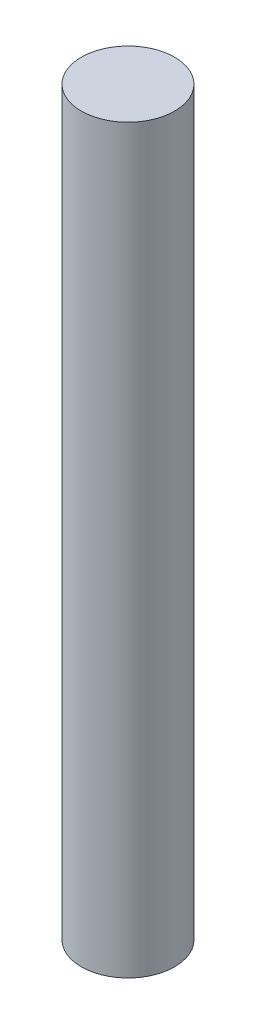
ISO-10303-21;
HEADER;
FILE_DESCRIPTION(('STEP AP214'),'2;1');
FILE_NAME('part.step','',(''),(''),'','','');
FILE_SCHEMA(('AUTOMOTIVE_DESIGN { 1 0 10303 214 1 1 1 1 }'));
ENDSEC;
DATA;
#1=APPLICATION_CONTEXT('core data for automotive mechanical design processes');
#2=APPLICATION_PROTOCOL_DEFINITION('international standard','automotive_design',2000,#1);
#3=PRODUCT_CONTEXT('',#1,'mechanical');
#4=PRODUCT('Part','Part','',(#3));
#5=PRODUCT_RELATED_PRODUCT_CATEGORY('part','',(#4));
#6=PRODUCT_DEFINITION_FORMATION('','',#4);
#7=PRODUCT_DEFINITION_CONTEXT('part definition',#1,'design');
#8=PRODUCT_DEFINITION('design','',#6,#7);
#9=PRODUCT_DEFINITION_SHAPE('','',#8);
#10=(LENGTH_UNIT() NAMED_UNIT(*) SI_UNIT(.MILLI.,.METRE.));
#11=(NAMED_UNIT(*) PLANE_ANGLE_UNIT() SI_UNIT($,.RADIAN.));
#12=(NAMED_UNIT(*) SI_UNIT($,.STERADIAN.) SOLID_ANGLE_UNIT());
#13=UNCERTAINTY_MEASURE_WITH_UNIT(LENGTH_MEASURE(1.E-05),#10,'distance_accuracy_value','');
#14=(GEOMETRIC_REPRESENTATION_CONTEXT(3) GLOBAL_UNCERTAINTY_ASSIGNED_CONTEXT((#13)) GLOBAL_UNIT_ASSIGNED_CONTEXT((#10,
#11,#12)) REPRESENTATION_CONTEXT('',''));
#15=CARTESIAN_POINT('',(0.,0.,0.));
#16=DIRECTION('',(0.,0.,1.));
#17=DIRECTION('',(1.,0.,0.));
#18=AXIS2_PLACEMENT_3D('',#15,#16,#17);
#19=CARTESIAN_POINT('',(0.,100.,0.));
#20=DIRECTION('',(0.,-1.,0.));
#21=DIRECTION('',(0.,0.,-1.));
#22=AXIS2_PLACEMENT_3D('',#19,#20,#21);
#23=CYLINDRICAL_SURFACE('',#22,6.3);
#24=CARTESIAN_POINT('',(0.,100.,0.));
#25=DIRECTION('',(0.,1.,0.));
#26=DIRECTION('',(0.,0.,1.));
#27=AXIS2_PLACEMENT_3D('',#24,#25,#26);
#28=CIRCLE('',#27,6.3);
#29=CARTESIAN_POINT('',(0.,100.,6.3));
#30=VERTEX_POINT('',#29);
#31=EDGE_CURVE('E10',#30,#30,#28,.T.);
#32=ORIENTED_EDGE('',*,*,#31,.F.);
#33=EDGE_LOOP('',(#32));
#34=FACE_BOUND('',#33,.T.);
#35=CARTESIAN_POINT('',(0.,0.,0.));
#36=DIRECTION('',(0.,1.,0.));
#37=DIRECTION('',(0.,0.,1.));
#38=AXIS2_PLACEMENT_3D('',#35,#36,#37);
#39=CIRCLE('',#38,6.3);
#40=CARTESIAN_POINT('',(0.,0.,6.3));
#41=VERTEX_POINT('',#40);
#42=EDGE_CURVE('E34',#41,#41,#39,.T.);
#43=ORIENTED_EDGE('',*,*,#42,.T.);
#44=EDGE_LOOP('',(#43));
#45=FACE_BOUND('',#44,.T.);
#46=ADVANCED_FACE('F31',(#34,#45),#23,.T.);
#47=CARTESIAN_POINT('',(0.,100.,0.));
#48=DIRECTION('',(0.,1.,0.));
#49=DIRECTION('',(0.,0.,1.));
#50=AXIS2_PLACEMENT_3D('',#47,#48,#49);
#51=PLANE('',#50);
#52=ORIENTED_EDGE('',*,*,#31,.T.);
#53=EDGE_LOOP('',(#52));
#54=FACE_BOUND('',#53,.T.);
#55=ADVANCED_FACE('F46',(#54),#51,.T.);
#56=CARTESIAN_POINT('',(0.,0.,0.));
#57=DIRECTION('',(0.,1.,0.));
#58=DIRECTION('',(0.,0.,1.));
#59=AXIS2_PLACEMENT_3D('',#56,#57,#58);
#60=PLANE('',#59);
#61=ORIENTED_EDGE('',*,*,#42,.F.);
#62=EDGE_LOOP('',(#61));
#63=FACE_BOUND('',#62,.T.);
#64=ADVANCED_FACE('F44',(#63),#60,.F.);
#65=CLOSED_SHELL('',(#46,#55,#64));
#66=MANIFOLD_SOLID_BREP('B2',#65);
#67=ADVANCED_BREP_SHAPE_REPRESENTATION('',(#18,#66),#14);
#68=SHAPE_DEFINITION_REPRESENTATION(#9,#67);
ENDSEC;
END-ISO-10303-21;
